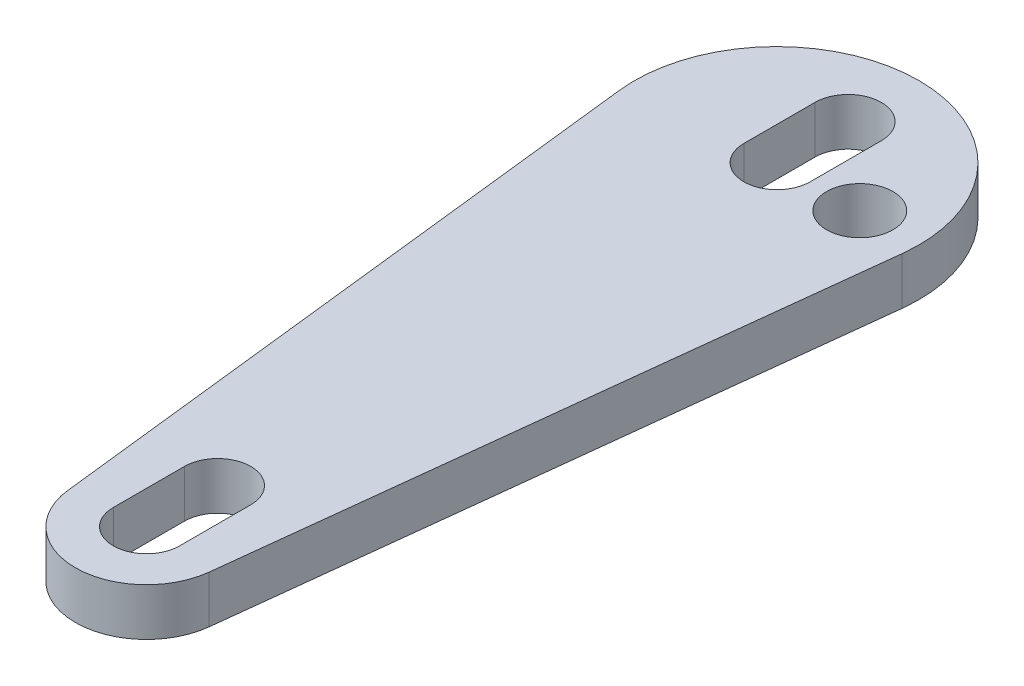
ISO-10303-21;
HEADER;
FILE_DESCRIPTION(('STEP AP214'),'2;1');
FILE_NAME('part.step','',(''),(''),'','','');
FILE_SCHEMA(('AUTOMOTIVE_DESIGN { 1 0 10303 214 1 1 1 1 }'));
ENDSEC;
DATA;
#1=APPLICATION_CONTEXT('core data for automotive mechanical design processes');
#2=APPLICATION_PROTOCOL_DEFINITION('international standard','automotive_design',2000,#1);
#3=PRODUCT_CONTEXT('',#1,'mechanical');
#4=PRODUCT('Part','Part','',(#3));
#5=PRODUCT_RELATED_PRODUCT_CATEGORY('part','',(#4));
#6=PRODUCT_DEFINITION_FORMATION('','',#4);
#7=PRODUCT_DEFINITION_CONTEXT('part definition',#1,'design');
#8=PRODUCT_DEFINITION('design','',#6,#7);
#9=PRODUCT_DEFINITION_SHAPE('','',#8);
#10=(LENGTH_UNIT() NAMED_UNIT(*) SI_UNIT(.MILLI.,.METRE.));
#11=(NAMED_UNIT(*) PLANE_ANGLE_UNIT() SI_UNIT($,.RADIAN.));
#12=(NAMED_UNIT(*) SI_UNIT($,.STERADIAN.) SOLID_ANGLE_UNIT());
#13=UNCERTAINTY_MEASURE_WITH_UNIT(LENGTH_MEASURE(1.E-05),#10,'distance_accuracy_value','');
#14=(GEOMETRIC_REPRESENTATION_CONTEXT(3) GLOBAL_UNCERTAINTY_ASSIGNED_CONTEXT((#13)) GLOBAL_UNIT_ASSIGNED_CONTEXT((#10,
#11,#12)) REPRESENTATION_CONTEXT('',''));
#15=CARTESIAN_POINT('',(0.,0.,0.));
#16=DIRECTION('',(0.,0.,1.));
#17=DIRECTION('',(1.,0.,0.));
#18=AXIS2_PLACEMENT_3D('',#15,#16,#17);
#19=CARTESIAN_POINT('',(0.,2.,-26.58));
#20=DIRECTION('',(0.,1.,0.));
#21=DIRECTION('',(0.,0.,1.));
#22=AXIS2_PLACEMENT_3D('',#19,#20,#21);
#23=PLANE('',#22);
#24=CARTESIAN_POINT('',(0.,2.,-26.58));
#25=DIRECTION('',(0.,1.,0.));
#26=DIRECTION('',(0.,0.,1.));
#27=AXIS2_PLACEMENT_3D('',#24,#25,#26);
#28=CIRCLE('',#27,6.);
#29=CARTESIAN_POINT('',(5.96166075326873,2.,-25.9027990970655));
#30=VERTEX_POINT('',#29);
#31=CARTESIAN_POINT('',(-5.96166075326873,2.,-25.9027990970655));
#32=VERTEX_POINT('',#31);
#33=EDGE_CURVE('E234',#30,#32,#28,.T.);
#34=ORIENTED_EDGE('',*,*,#33,.T.);
#35=DIRECTION('',(0.112866817155756,0.,0.993610125544788));
#36=VECTOR('',#35,1.);
#37=CARTESIAN_POINT('',(-5.96166075326873,2.,-25.9027990970655));
#38=LINE('',#37,#36);
#39=CARTESIAN_POINT('',(-2.98083037663436,2.,0.338600451467269));
#40=VERTEX_POINT('',#39);
#41=EDGE_CURVE('E238',#32,#40,#38,.T.);
#42=ORIENTED_EDGE('',*,*,#41,.T.);
#43=CARTESIAN_POINT('',(0.,2.,0.));
#44=DIRECTION('',(0.,1.,0.));
#45=DIRECTION('',(0.,0.,1.));
#46=AXIS2_PLACEMENT_3D('',#43,#44,#45);
#47=CIRCLE('',#46,3.);
#48=CARTESIAN_POINT('',(2.98083037663437,2.,0.338600451467268));
#49=VERTEX_POINT('',#48);
#50=EDGE_CURVE('E242',#40,#49,#47,.T.);
#51=ORIENTED_EDGE('',*,*,#50,.T.);
#52=DIRECTION('',(0.112866817155756,0.,-0.993610125544788));
#53=VECTOR('',#52,1.);
#54=CARTESIAN_POINT('',(5.96166075326873,2.,-25.9027990970655));
#55=LINE('',#54,#53);
#56=EDGE_CURVE('E245',#49,#30,#55,.T.);
#57=ORIENTED_EDGE('',*,*,#56,.T.);
#58=EDGE_LOOP('',(#34,#42,#51,#57));
#59=FACE_BOUND('',#58,.T.);
#60=CARTESIAN_POINT('',(3.5,2.,-26.58));
#61=DIRECTION('',(0.,1.,0.));
#62=DIRECTION('',(0.,0.,1.));
#63=AXIS2_PLACEMENT_3D('',#60,#61,#62);
#64=CIRCLE('',#63,1.4);
#65=CARTESIAN_POINT('',(3.5,2.,-25.18));
#66=VERTEX_POINT('',#65);
#67=EDGE_CURVE('E226',#66,#66,#64,.T.);
#68=ORIENTED_EDGE('',*,*,#67,.F.);
#69=EDGE_LOOP('',(#68));
#70=FACE_BOUND('',#69,.T.);
#71=DIRECTION('',(0.,0.,-1.));
#72=VECTOR('',#71,1.);
#73=CARTESIAN_POINT('',(1.40000000000001,2.,0.));
#74=LINE('',#73,#72);
#75=CARTESIAN_POINT('',(1.40000000000001,2.,0.));
#76=VERTEX_POINT('',#75);
#77=CARTESIAN_POINT('',(1.40000000000001,2.,-3.));
#78=VERTEX_POINT('',#77);
#79=EDGE_CURVE('E186',#76,#78,#74,.T.);
#80=ORIENTED_EDGE('',*,*,#79,.F.);
#81=CARTESIAN_POINT('',(0.,2.,0.));
#82=DIRECTION('',(0.,1.,0.));
#83=DIRECTION('',(0.,0.,1.));
#84=AXIS2_PLACEMENT_3D('',#81,#82,#83);
#85=CIRCLE('',#84,1.4);
#86=CARTESIAN_POINT('',(-1.4,2.,0.));
#87=VERTEX_POINT('',#86);
#88=EDGE_CURVE('E183',#87,#76,#85,.T.);
#89=ORIENTED_EDGE('',*,*,#88,.F.);
#90=DIRECTION('',(0.,0.,1.));
#91=VECTOR('',#90,1.);
#92=CARTESIAN_POINT('',(-1.4,2.,0.));
#93=LINE('',#92,#91);
#94=CARTESIAN_POINT('',(-1.4,2.,-3.));
#95=VERTEX_POINT('',#94);
#96=EDGE_CURVE('E194',#95,#87,#93,.T.);
#97=ORIENTED_EDGE('',*,*,#96,.F.);
#98=CARTESIAN_POINT('',(0.,2.,-3.));
#99=DIRECTION('',(0.,1.,0.));
#100=DIRECTION('',(0.,0.,1.));
#101=AXIS2_PLACEMENT_3D('',#98,#99,#100);
#102=CIRCLE('',#101,1.4);
#103=EDGE_CURVE('E190',#78,#95,#102,.T.);
#104=ORIENTED_EDGE('',*,*,#103,.F.);
#105=EDGE_LOOP('',(#80,#89,#97,#104));
#106=FACE_BOUND('',#105,.T.);
#107=DIRECTION('',(0.,0.,1.));
#108=VECTOR('',#107,1.);
#109=CARTESIAN_POINT('',(-1.4,2.,-29.59));
#110=LINE('',#109,#108);
#111=CARTESIAN_POINT('',(-1.4,2.,-29.59));
#112=VERTEX_POINT('',#111);
#113=CARTESIAN_POINT('',(-1.4,2.,-26.59));
#114=VERTEX_POINT('',#113);
#115=EDGE_CURVE('E144',#112,#114,#110,.T.);
#116=ORIENTED_EDGE('',*,*,#115,.F.);
#117=CARTESIAN_POINT('',(0.,2.,-29.59));
#118=DIRECTION('',(0.,1.,0.));
#119=DIRECTION('',(0.,0.,1.));
#120=AXIS2_PLACEMENT_3D('',#117,#118,#119);
#121=CIRCLE('',#120,1.4);
#122=CARTESIAN_POINT('',(1.4,2.,-29.59));
#123=VERTEX_POINT('',#122);
#124=EDGE_CURVE('E135',#123,#112,#121,.T.);
#125=ORIENTED_EDGE('',*,*,#124,.F.);
#126=DIRECTION('',(0.,0.,-1.));
#127=VECTOR('',#126,1.);
#128=CARTESIAN_POINT('',(1.4,2.,-29.59));
#129=LINE('',#128,#127);
#130=CARTESIAN_POINT('',(1.4,2.,-26.59));
#131=VERTEX_POINT('',#130);
#132=EDGE_CURVE('E161',#131,#123,#129,.T.);
#133=ORIENTED_EDGE('',*,*,#132,.F.);
#134=CARTESIAN_POINT('',(0.,2.,-26.59));
#135=DIRECTION('',(0.,1.,0.));
#136=DIRECTION('',(0.,0.,1.));
#137=AXIS2_PLACEMENT_3D('',#134,#135,#136);
#138=CIRCLE('',#137,1.4);
#139=EDGE_CURVE('E157',#114,#131,#138,.T.);
#140=ORIENTED_EDGE('',*,*,#139,.F.);
#141=EDGE_LOOP('',(#116,#125,#133,#140));
#142=FACE_BOUND('',#141,.T.);
#143=ADVANCED_FACE('F45',(#59,#70,#106,#142),#23,.T.);
#144=CARTESIAN_POINT('',(0.,0.,-26.58));
#145=DIRECTION('',(0.,1.,0.));
#146=DIRECTION('',(0.,0.,1.));
#147=AXIS2_PLACEMENT_3D('',#144,#145,#146);
#148=PLANE('',#147);
#149=CARTESIAN_POINT('',(0.,0.,0.));
#150=DIRECTION('',(0.,1.,0.));
#151=DIRECTION('',(0.,0.,1.));
#152=AXIS2_PLACEMENT_3D('',#149,#150,#151);
#153=CIRCLE('',#152,1.4);
#154=CARTESIAN_POINT('',(-1.4,0.,0.));
#155=VERTEX_POINT('',#154);
#156=CARTESIAN_POINT('',(1.40000000000001,0.,0.));
#157=VERTEX_POINT('',#156);
#158=EDGE_CURVE('E153',#155,#157,#153,.T.);
#159=ORIENTED_EDGE('',*,*,#158,.T.);
#160=DIRECTION('',(0.,0.,-1.));
#161=VECTOR('',#160,1.);
#162=CARTESIAN_POINT('',(1.40000000000001,0.,0.));
#163=LINE('',#162,#161);
#164=CARTESIAN_POINT('',(1.40000000000001,0.,-3.));
#165=VERTEX_POINT('',#164);
#166=EDGE_CURVE('E201',#157,#165,#163,.T.);
#167=ORIENTED_EDGE('',*,*,#166,.T.);
#168=CARTESIAN_POINT('',(0.,0.,-3.));
#169=DIRECTION('',(0.,1.,0.));
#170=DIRECTION('',(0.,0.,1.));
#171=AXIS2_PLACEMENT_3D('',#168,#169,#170);
#172=CIRCLE('',#171,1.4);
#173=CARTESIAN_POINT('',(-1.4,0.,-3.));
#174=VERTEX_POINT('',#173);
#175=EDGE_CURVE('E205',#165,#174,#172,.T.);
#176=ORIENTED_EDGE('',*,*,#175,.T.);
#177=DIRECTION('',(0.,0.,1.));
#178=VECTOR('',#177,1.);
#179=CARTESIAN_POINT('',(-1.4,0.,0.));
#180=LINE('',#179,#178);
#181=EDGE_CURVE('E187',#174,#155,#180,.T.);
#182=ORIENTED_EDGE('',*,*,#181,.T.);
#183=EDGE_LOOP('',(#159,#167,#176,#182));
#184=FACE_BOUND('',#183,.T.);
#185=CARTESIAN_POINT('',(0.,0.,-26.58));
#186=DIRECTION('',(0.,1.,0.));
#187=DIRECTION('',(0.,0.,1.));
#188=AXIS2_PLACEMENT_3D('',#185,#186,#187);
#189=CIRCLE('',#188,6.);
#190=CARTESIAN_POINT('',(5.96166075326873,0.,-25.9027990970655));
#191=VERTEX_POINT('',#190);
#192=CARTESIAN_POINT('',(-5.96166075326873,0.,-25.9027990970655));
#193=VERTEX_POINT('',#192);
#194=EDGE_CURVE('E230',#191,#193,#189,.T.);
#195=ORIENTED_EDGE('',*,*,#194,.F.);
#196=DIRECTION('',(0.112866817155756,0.,-0.993610125544788));
#197=VECTOR('',#196,1.);
#198=CARTESIAN_POINT('',(5.96166075326873,0.,-25.9027990970655));
#199=LINE('',#198,#197);
#200=CARTESIAN_POINT('',(2.98083037663437,0.,0.338600451467268));
#201=VERTEX_POINT('',#200);
#202=EDGE_CURVE('E239',#201,#191,#199,.T.);
#203=ORIENTED_EDGE('',*,*,#202,.F.);
#204=CARTESIAN_POINT('',(0.,0.,0.));
#205=DIRECTION('',(0.,1.,0.));
#206=DIRECTION('',(0.,0.,1.));
#207=AXIS2_PLACEMENT_3D('',#204,#205,#206);
#208=CIRCLE('',#207,3.);
#209=CARTESIAN_POINT('',(-2.98083037663436,0.,0.338600451467269));
#210=VERTEX_POINT('',#209);
#211=EDGE_CURVE('E255',#210,#201,#208,.T.);
#212=ORIENTED_EDGE('',*,*,#211,.F.);
#213=DIRECTION('',(0.112866817155756,0.,0.993610125544788));
#214=VECTOR('',#213,1.);
#215=CARTESIAN_POINT('',(-5.96166075326873,0.,-25.9027990970655));
#216=LINE('',#215,#214);
#217=EDGE_CURVE('E252',#193,#210,#216,.T.);
#218=ORIENTED_EDGE('',*,*,#217,.F.);
#219=EDGE_LOOP('',(#195,#203,#212,#218));
#220=FACE_BOUND('',#219,.T.);
#221=CARTESIAN_POINT('',(3.5,0.,-26.58));
#222=DIRECTION('',(0.,1.,0.));
#223=DIRECTION('',(0.,0.,1.));
#224=AXIS2_PLACEMENT_3D('',#221,#222,#223);
#225=CIRCLE('',#224,1.4);
#226=CARTESIAN_POINT('',(3.5,0.,-25.18));
#227=VERTEX_POINT('',#226);
#228=EDGE_CURVE('E225',#227,#227,#225,.T.);
#229=ORIENTED_EDGE('',*,*,#228,.T.);
#230=EDGE_LOOP('',(#229));
#231=FACE_BOUND('',#230,.T.);
#232=CARTESIAN_POINT('',(0.,0.,-29.59));
#233=DIRECTION('',(0.,1.,0.));
#234=DIRECTION('',(0.,0.,1.));
#235=AXIS2_PLACEMENT_3D('',#232,#233,#234);
#236=CIRCLE('',#235,1.4);
#237=CARTESIAN_POINT('',(1.4,0.,-29.59));
#238=VERTEX_POINT('',#237);
#239=CARTESIAN_POINT('',(-1.4,0.,-29.59));
#240=VERTEX_POINT('',#239);
#241=EDGE_CURVE('E69',#238,#240,#236,.T.);
#242=ORIENTED_EDGE('',*,*,#241,.T.);
#243=DIRECTION('',(0.,0.,1.));
#244=VECTOR('',#243,1.);
#245=CARTESIAN_POINT('',(-1.4,0.,-29.59));
#246=LINE('',#245,#244);
#247=CARTESIAN_POINT('',(-1.4,0.,-26.59));
#248=VERTEX_POINT('',#247);
#249=EDGE_CURVE('E151',#240,#248,#246,.T.);
#250=ORIENTED_EDGE('',*,*,#249,.T.);
#251=CARTESIAN_POINT('',(0.,0.,-26.59));
#252=DIRECTION('',(0.,1.,0.));
#253=DIRECTION('',(0.,0.,1.));
#254=AXIS2_PLACEMENT_3D('',#251,#252,#253);
#255=CIRCLE('',#254,1.4);
#256=CARTESIAN_POINT('',(1.4,0.,-26.59));
#257=VERTEX_POINT('',#256);
#258=EDGE_CURVE('E170',#248,#257,#255,.T.);
#259=ORIENTED_EDGE('',*,*,#258,.T.);
#260=DIRECTION('',(0.,0.,-1.));
#261=VECTOR('',#260,1.);
#262=CARTESIAN_POINT('',(1.4,0.,-29.59));
#263=LINE('',#262,#261);
#264=EDGE_CURVE('E145',#257,#238,#263,.T.);
#265=ORIENTED_EDGE('',*,*,#264,.T.);
#266=EDGE_LOOP('',(#242,#250,#259,#265));
#267=FACE_BOUND('',#266,.T.);
#268=ADVANCED_FACE('F278',(#184,#220,#231,#267),#148,.F.);
#269=CARTESIAN_POINT('',(0.,2.,-26.58));
#270=DIRECTION('',(0.,-1.,0.));
#271=DIRECTION('',(0.,0.,-1.));
#272=AXIS2_PLACEMENT_3D('',#269,#270,#271);
#273=CYLINDRICAL_SURFACE('',#272,6.);
#274=ORIENTED_EDGE('',*,*,#194,.T.);
#275=DIRECTION('',(0.,-1.,0.));
#276=VECTOR('',#275,1.);
#277=CARTESIAN_POINT('',(-5.96166075326873,2.,-25.9027990970655));
#278=LINE('',#277,#276);
#279=EDGE_CURVE('E11',#32,#193,#278,.T.);
#280=ORIENTED_EDGE('',*,*,#279,.F.);
#281=ORIENTED_EDGE('',*,*,#33,.F.);
#282=DIRECTION('',(0.,-1.,0.));
#283=VECTOR('',#282,1.);
#284=CARTESIAN_POINT('',(5.96166075326873,2.,-25.9027990970655));
#285=LINE('',#284,#283);
#286=EDGE_CURVE('E248',#30,#191,#285,.T.);
#287=ORIENTED_EDGE('',*,*,#286,.T.);
#288=EDGE_LOOP('',(#274,#280,#281,#287));
#289=FACE_BOUND('',#288,.T.);
#290=ADVANCED_FACE('F47',(#289),#273,.T.);
#291=CARTESIAN_POINT('',(-5.96166075326873,2.,-25.9027990970655));
#292=DIRECTION('',(0.993610125544788,0.,-0.112866817155756));
#293=DIRECTION('',(-0.112866817155756,0.,-0.993610125544788));
#294=AXIS2_PLACEMENT_3D('',#291,#292,#293);
#295=PLANE('',#294);
#296=ORIENTED_EDGE('',*,*,#217,.T.);
#297=DIRECTION('',(0.,-1.,0.));
#298=VECTOR('',#297,1.);
#299=CARTESIAN_POINT('',(-2.98083037663436,2.,0.338600451467269));
#300=LINE('',#299,#298);
#301=EDGE_CURVE('E54',#40,#210,#300,.T.);
#302=ORIENTED_EDGE('',*,*,#301,.F.);
#303=ORIENTED_EDGE('',*,*,#41,.F.);
#304=ORIENTED_EDGE('',*,*,#279,.T.);
#305=EDGE_LOOP('',(#296,#302,#303,#304));
#306=FACE_BOUND('',#305,.T.);
#307=ADVANCED_FACE('F289',(#306),#295,.F.);
#308=CARTESIAN_POINT('',(0.,2.,0.));
#309=DIRECTION('',(0.,-1.,0.));
#310=DIRECTION('',(0.,0.,-1.));
#311=AXIS2_PLACEMENT_3D('',#308,#309,#310);
#312=CYLINDRICAL_SURFACE('',#311,3.);
#313=ORIENTED_EDGE('',*,*,#211,.T.);
#314=DIRECTION('',(0.,-1.,0.));
#315=VECTOR('',#314,1.);
#316=CARTESIAN_POINT('',(2.98083037663437,2.,0.338600451467268));
#317=LINE('',#316,#315);
#318=EDGE_CURVE('E263',#49,#201,#317,.T.);
#319=ORIENTED_EDGE('',*,*,#318,.F.);
#320=ORIENTED_EDGE('',*,*,#50,.F.);
#321=ORIENTED_EDGE('',*,*,#301,.T.);
#322=EDGE_LOOP('',(#313,#319,#320,#321));
#323=FACE_BOUND('',#322,.T.);
#324=ADVANCED_FACE('F272',(#323),#312,.T.);
#325=CARTESIAN_POINT('',(5.96166075326873,2.,-25.9027990970655));
#326=DIRECTION('',(-0.993610125544788,0.,-0.112866817155756));
#327=DIRECTION('',(-0.112866817155756,0.,0.993610125544788));
#328=AXIS2_PLACEMENT_3D('',#325,#326,#327);
#329=PLANE('',#328);
#330=ORIENTED_EDGE('',*,*,#202,.T.);
#331=ORIENTED_EDGE('',*,*,#286,.F.);
#332=ORIENTED_EDGE('',*,*,#56,.F.);
#333=ORIENTED_EDGE('',*,*,#318,.T.);
#334=EDGE_LOOP('',(#330,#331,#332,#333));
#335=FACE_BOUND('',#334,.T.);
#336=ADVANCED_FACE('F282',(#335),#329,.F.);
#337=CARTESIAN_POINT('',(3.5,2.,-26.58));
#338=DIRECTION('',(0.,-1.,0.));
#339=DIRECTION('',(0.,0.,-1.));
#340=AXIS2_PLACEMENT_3D('',#337,#338,#339);
#341=CYLINDRICAL_SURFACE('',#340,1.4);
#342=ORIENTED_EDGE('',*,*,#67,.T.);
#343=EDGE_LOOP('',(#342));
#344=FACE_BOUND('',#343,.T.);
#345=ORIENTED_EDGE('',*,*,#228,.F.);
#346=EDGE_LOOP('',(#345));
#347=FACE_BOUND('',#346,.T.);
#348=ADVANCED_FACE('F304',(#344,#347),#341,.F.);
#349=CARTESIAN_POINT('',(0.,2.,0.));
#350=DIRECTION('',(0.,-1.,0.));
#351=DIRECTION('',(0.,0.,-1.));
#352=AXIS2_PLACEMENT_3D('',#349,#350,#351);
#353=CYLINDRICAL_SURFACE('',#352,1.4);
#354=ORIENTED_EDGE('',*,*,#158,.F.);
#355=DIRECTION('',(0.,-1.,0.));
#356=VECTOR('',#355,1.);
#357=CARTESIAN_POINT('',(-1.4,2.,0.));
#358=LINE('',#357,#356);
#359=EDGE_CURVE('E197',#87,#155,#358,.T.);
#360=ORIENTED_EDGE('',*,*,#359,.F.);
#361=ORIENTED_EDGE('',*,*,#88,.T.);
#362=DIRECTION('',(0.,-1.,0.));
#363=VECTOR('',#362,1.);
#364=CARTESIAN_POINT('',(1.40000000000001,2.,0.));
#365=LINE('',#364,#363);
#366=EDGE_CURVE('E221',#76,#157,#365,.T.);
#367=ORIENTED_EDGE('',*,*,#366,.T.);
#368=EDGE_LOOP('',(#354,#360,#361,#367));
#369=FACE_BOUND('',#368,.T.);
#370=ADVANCED_FACE('F311',(#369),#353,.F.);
#371=CARTESIAN_POINT('',(1.40000000000001,2.,0.));
#372=DIRECTION('',(-1.,0.,0.));
#373=DIRECTION('',(0.,0.,1.));
#374=AXIS2_PLACEMENT_3D('',#371,#372,#373);
#375=PLANE('',#374);
#376=ORIENTED_EDGE('',*,*,#166,.F.);
#377=ORIENTED_EDGE('',*,*,#366,.F.);
#378=ORIENTED_EDGE('',*,*,#79,.T.);
#379=DIRECTION('',(0.,-1.,0.));
#380=VECTOR('',#379,1.);
#381=CARTESIAN_POINT('',(1.40000000000001,2.,-3.));
#382=LINE('',#381,#380);
#383=EDGE_CURVE('E218',#78,#165,#382,.T.);
#384=ORIENTED_EDGE('',*,*,#383,.T.);
#385=EDGE_LOOP('',(#376,#377,#378,#384));
#386=FACE_BOUND('',#385,.T.);
#387=ADVANCED_FACE('F316',(#386),#375,.T.);
#388=CARTESIAN_POINT('',(0.,2.,-3.));
#389=DIRECTION('',(0.,-1.,0.));
#390=DIRECTION('',(0.,0.,-1.));
#391=AXIS2_PLACEMENT_3D('',#388,#389,#390);
#392=CYLINDRICAL_SURFACE('',#391,1.4);
#393=ORIENTED_EDGE('',*,*,#175,.F.);
#394=ORIENTED_EDGE('',*,*,#383,.F.);
#395=ORIENTED_EDGE('',*,*,#103,.T.);
#396=DIRECTION('',(0.,-1.,0.));
#397=VECTOR('',#396,1.);
#398=CARTESIAN_POINT('',(-1.4,2.,-3.));
#399=LINE('',#398,#397);
#400=EDGE_CURVE('E215',#95,#174,#399,.T.);
#401=ORIENTED_EDGE('',*,*,#400,.T.);
#402=EDGE_LOOP('',(#393,#394,#395,#401));
#403=FACE_BOUND('',#402,.T.);
#404=ADVANCED_FACE('F340',(#403),#392,.F.);
#405=CARTESIAN_POINT('',(-1.4,2.,0.));
#406=DIRECTION('',(1.,0.,0.));
#407=DIRECTION('',(0.,0.,-1.));
#408=AXIS2_PLACEMENT_3D('',#405,#406,#407);
#409=PLANE('',#408);
#410=ORIENTED_EDGE('',*,*,#181,.F.);
#411=ORIENTED_EDGE('',*,*,#400,.F.);
#412=ORIENTED_EDGE('',*,*,#96,.T.);
#413=ORIENTED_EDGE('',*,*,#359,.T.);
#414=EDGE_LOOP('',(#410,#411,#412,#413));
#415=FACE_BOUND('',#414,.T.);
#416=ADVANCED_FACE('F337',(#415),#409,.T.);
#417=CARTESIAN_POINT('',(0.,2.,-29.59));
#418=DIRECTION('',(0.,-1.,0.));
#419=DIRECTION('',(0.,0.,-1.));
#420=AXIS2_PLACEMENT_3D('',#417,#418,#419);
#421=CYLINDRICAL_SURFACE('',#420,1.4);
#422=ORIENTED_EDGE('',*,*,#241,.F.);
#423=DIRECTION('',(0.,-1.,0.));
#424=VECTOR('',#423,1.);
#425=CARTESIAN_POINT('',(1.4,2.,-29.59));
#426=LINE('',#425,#424);
#427=EDGE_CURVE('E139',#123,#238,#426,.T.);
#428=ORIENTED_EDGE('',*,*,#427,.F.);
#429=ORIENTED_EDGE('',*,*,#124,.T.);
#430=DIRECTION('',(0.,-1.,0.));
#431=VECTOR('',#430,1.);
#432=CARTESIAN_POINT('',(-1.4,2.,-29.59));
#433=LINE('',#432,#431);
#434=EDGE_CURVE('E138',#112,#240,#433,.T.);
#435=ORIENTED_EDGE('',*,*,#434,.T.);
#436=EDGE_LOOP('',(#422,#428,#429,#435));
#437=FACE_BOUND('',#436,.T.);
#438=ADVANCED_FACE('F137',(#437),#421,.F.);
#439=CARTESIAN_POINT('',(-1.4,2.,-29.59));
#440=DIRECTION('',(1.,0.,0.));
#441=DIRECTION('',(0.,0.,-1.));
#442=AXIS2_PLACEMENT_3D('',#439,#440,#441);
#443=PLANE('',#442);
#444=ORIENTED_EDGE('',*,*,#249,.F.);
#445=ORIENTED_EDGE('',*,*,#434,.F.);
#446=ORIENTED_EDGE('',*,*,#115,.T.);
#447=DIRECTION('',(0.,-1.,0.));
#448=VECTOR('',#447,1.);
#449=CARTESIAN_POINT('',(-1.4,2.,-26.59));
#450=LINE('',#449,#448);
#451=EDGE_CURVE('E154',#114,#248,#450,.T.);
#452=ORIENTED_EDGE('',*,*,#451,.T.);
#453=EDGE_LOOP('',(#444,#445,#446,#452));
#454=FACE_BOUND('',#453,.T.);
#455=ADVANCED_FACE('F148',(#454),#443,.T.);
#456=CARTESIAN_POINT('',(0.,2.,-26.59));
#457=DIRECTION('',(0.,-1.,0.));
#458=DIRECTION('',(0.,0.,-1.));
#459=AXIS2_PLACEMENT_3D('',#456,#457,#458);
#460=CYLINDRICAL_SURFACE('',#459,1.4);
#461=ORIENTED_EDGE('',*,*,#258,.F.);
#462=ORIENTED_EDGE('',*,*,#451,.F.);
#463=ORIENTED_EDGE('',*,*,#139,.T.);
#464=DIRECTION('',(0.,-1.,0.));
#465=VECTOR('',#464,1.);
#466=CARTESIAN_POINT('',(1.4,2.,-26.59));
#467=LINE('',#466,#465);
#468=EDGE_CURVE('E61',#131,#257,#467,.T.);
#469=ORIENTED_EDGE('',*,*,#468,.T.);
#470=EDGE_LOOP('',(#461,#462,#463,#469));
#471=FACE_BOUND('',#470,.T.);
#472=ADVANCED_FACE('F325',(#471),#460,.F.);
#473=CARTESIAN_POINT('',(1.4,2.,-29.59));
#474=DIRECTION('',(-1.,0.,0.));
#475=DIRECTION('',(0.,0.,1.));
#476=AXIS2_PLACEMENT_3D('',#473,#474,#475);
#477=PLANE('',#476);
#478=ORIENTED_EDGE('',*,*,#264,.F.);
#479=ORIENTED_EDGE('',*,*,#468,.F.);
#480=ORIENTED_EDGE('',*,*,#132,.T.);
#481=ORIENTED_EDGE('',*,*,#427,.T.);
#482=EDGE_LOOP('',(#478,#479,#480,#481));
#483=FACE_BOUND('',#482,.T.);
#484=ADVANCED_FACE('F323',(#483),#477,.T.);
#485=CLOSED_SHELL('',(#143,#268,#290,#307,#324,#336,#348,#370,#387,#404,#416,#438,#455,#472,#484));
#486=MANIFOLD_SOLID_BREP('B2',#485);
#487=ADVANCED_BREP_SHAPE_REPRESENTATION('',(#18,#486),#14);
#488=SHAPE_DEFINITION_REPRESENTATION(#9,#487);
ENDSEC;
END-ISO-10303-21;
